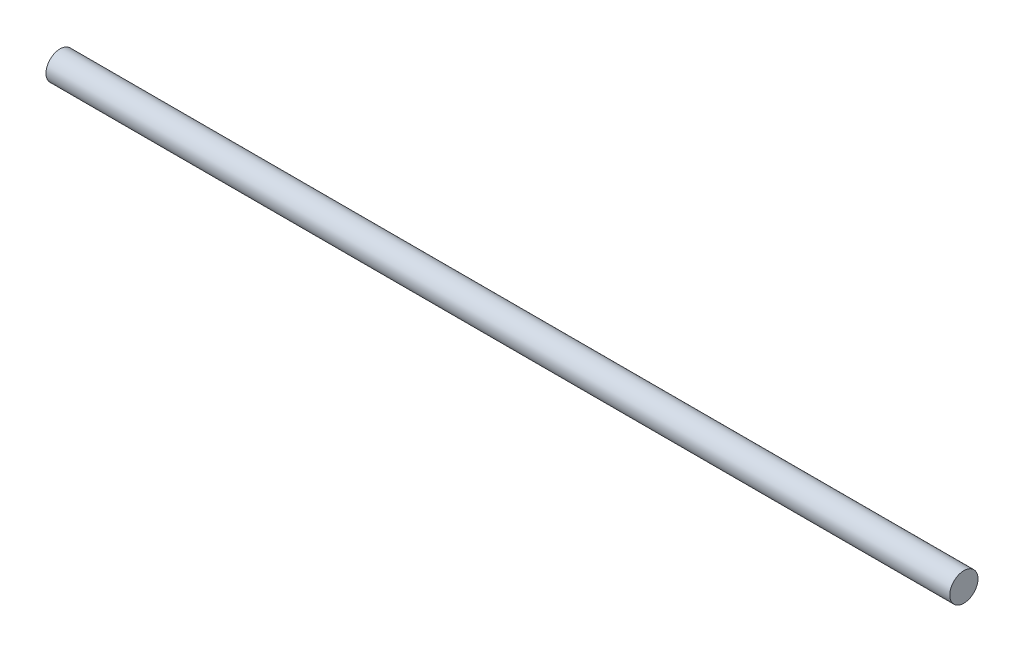
ISO-10303-21;
HEADER;
FILE_DESCRIPTION(('STEP AP214'),'2;1');
FILE_NAME('part.step','',(''),(''),'','','');
FILE_SCHEMA(('AUTOMOTIVE_DESIGN { 1 0 10303 214 1 1 1 1 }'));
ENDSEC;
DATA;
#1=APPLICATION_CONTEXT('core data for automotive mechanical design processes');
#2=APPLICATION_PROTOCOL_DEFINITION('international standard','automotive_design',2000,#1);
#3=PRODUCT_CONTEXT('',#1,'mechanical');
#4=PRODUCT('Part','Part','',(#3));
#5=PRODUCT_RELATED_PRODUCT_CATEGORY('part','',(#4));
#6=PRODUCT_DEFINITION_FORMATION('','',#4);
#7=PRODUCT_DEFINITION_CONTEXT('part definition',#1,'design');
#8=PRODUCT_DEFINITION('design','',#6,#7);
#9=PRODUCT_DEFINITION_SHAPE('','',#8);
#10=(LENGTH_UNIT() NAMED_UNIT(*) SI_UNIT(.MILLI.,.METRE.));
#11=(NAMED_UNIT(*) PLANE_ANGLE_UNIT() SI_UNIT($,.RADIAN.));
#12=(NAMED_UNIT(*) SI_UNIT($,.STERADIAN.) SOLID_ANGLE_UNIT());
#13=UNCERTAINTY_MEASURE_WITH_UNIT(LENGTH_MEASURE(1.E-05),#10,'distance_accuracy_value','');
#14=(GEOMETRIC_REPRESENTATION_CONTEXT(3) GLOBAL_UNCERTAINTY_ASSIGNED_CONTEXT((#13)) GLOBAL_UNIT_ASSIGNED_CONTEXT((#10,
#11,#12)) REPRESENTATION_CONTEXT('',''));
#15=CARTESIAN_POINT('',(0.,0.,0.));
#16=DIRECTION('',(0.,0.,1.));
#17=DIRECTION('',(1.,0.,0.));
#18=AXIS2_PLACEMENT_3D('',#15,#16,#17);
#19=CARTESIAN_POINT('',(800.,0.,0.));
#20=DIRECTION('',(-1.,0.,0.));
#21=DIRECTION('',(0.,0.,1.));
#22=AXIS2_PLACEMENT_3D('',#19,#20,#21);
#23=CYLINDRICAL_SURFACE('',#22,12.5);
#24=CARTESIAN_POINT('',(800.,0.,0.));
#25=DIRECTION('',(1.,0.,0.));
#26=DIRECTION('',(0.,0.,-1.));
#27=AXIS2_PLACEMENT_3D('',#24,#25,#26);
#28=CIRCLE('',#27,12.5);
#29=CARTESIAN_POINT('',(800.,0.,-12.5));
#30=VERTEX_POINT('',#29);
#31=EDGE_CURVE('E10',#30,#30,#28,.T.);
#32=ORIENTED_EDGE('',*,*,#31,.F.);
#33=EDGE_LOOP('',(#32));
#34=FACE_BOUND('',#33,.T.);
#35=CARTESIAN_POINT('',(0.,0.,0.));
#36=DIRECTION('',(1.,0.,0.));
#37=DIRECTION('',(0.,0.,-1.));
#38=AXIS2_PLACEMENT_3D('',#35,#36,#37);
#39=CIRCLE('',#38,12.5);
#40=CARTESIAN_POINT('',(0.,0.,-12.5));
#41=VERTEX_POINT('',#40);
#42=EDGE_CURVE('E37',#41,#41,#39,.T.);
#43=ORIENTED_EDGE('',*,*,#42,.T.);
#44=EDGE_LOOP('',(#43));
#45=FACE_BOUND('',#44,.T.);
#46=ADVANCED_FACE('F34',(#34,#45),#23,.T.);
#47=CARTESIAN_POINT('',(800.,0.,0.));
#48=DIRECTION('',(1.,0.,0.));
#49=DIRECTION('',(0.,0.,-1.));
#50=AXIS2_PLACEMENT_3D('',#47,#48,#49);
#51=PLANE('',#50);
#52=ORIENTED_EDGE('',*,*,#31,.T.);
#53=EDGE_LOOP('',(#52));
#54=FACE_BOUND('',#53,.T.);
#55=ADVANCED_FACE('F49',(#54),#51,.T.);
#56=CARTESIAN_POINT('',(0.,0.,0.));
#57=DIRECTION('',(1.,0.,0.));
#58=DIRECTION('',(0.,0.,-1.));
#59=AXIS2_PLACEMENT_3D('',#56,#57,#58);
#60=PLANE('',#59);
#61=ORIENTED_EDGE('',*,*,#42,.F.);
#62=EDGE_LOOP('',(#61));
#63=FACE_BOUND('',#62,.T.);
#64=ADVANCED_FACE('F47',(#63),#60,.F.);
#65=CLOSED_SHELL('',(#46,#55,#64));
#66=MANIFOLD_SOLID_BREP('B2',#65);
#67=ADVANCED_BREP_SHAPE_REPRESENTATION('',(#18,#66),#14);
#68=SHAPE_DEFINITION_REPRESENTATION(#9,#67);
ENDSEC;
END-ISO-10303-21;
